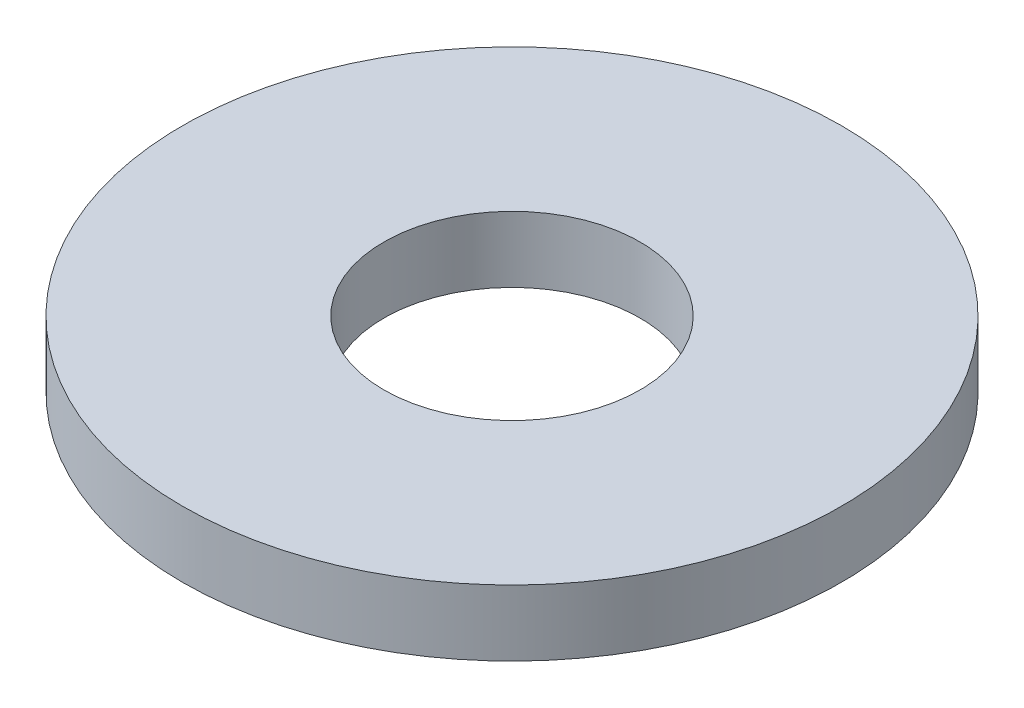
ISO-10303-21;
HEADER;
FILE_DESCRIPTION(('STEP AP214'),'2;1');
FILE_NAME('part.step','',(''),(''),'','','');
FILE_SCHEMA(('AUTOMOTIVE_DESIGN { 1 0 10303 214 1 1 1 1 }'));
ENDSEC;
DATA;
#1=APPLICATION_CONTEXT('core data for automotive mechanical design processes');
#2=APPLICATION_PROTOCOL_DEFINITION('international standard','automotive_design',2000,#1);
#3=PRODUCT_CONTEXT('',#1,'mechanical');
#4=PRODUCT('Part','Part','',(#3));
#5=PRODUCT_RELATED_PRODUCT_CATEGORY('part','',(#4));
#6=PRODUCT_DEFINITION_FORMATION('','',#4);
#7=PRODUCT_DEFINITION_CONTEXT('part definition',#1,'design');
#8=PRODUCT_DEFINITION('design','',#6,#7);
#9=PRODUCT_DEFINITION_SHAPE('','',#8);
#10=(LENGTH_UNIT() NAMED_UNIT(*) SI_UNIT(.MILLI.,.METRE.));
#11=(NAMED_UNIT(*) PLANE_ANGLE_UNIT() SI_UNIT($,.RADIAN.));
#12=(NAMED_UNIT(*) SI_UNIT($,.STERADIAN.) SOLID_ANGLE_UNIT());
#13=UNCERTAINTY_MEASURE_WITH_UNIT(LENGTH_MEASURE(1.E-05),#10,'distance_accuracy_value','');
#14=(GEOMETRIC_REPRESENTATION_CONTEXT(3) GLOBAL_UNCERTAINTY_ASSIGNED_CONTEXT((#13)) GLOBAL_UNIT_ASSIGNED_CONTEXT((#10,
#11,#12)) REPRESENTATION_CONTEXT('',''));
#15=CARTESIAN_POINT('',(0.,0.,0.));
#16=DIRECTION('',(0.,0.,1.));
#17=DIRECTION('',(1.,0.,0.));
#18=AXIS2_PLACEMENT_3D('',#15,#16,#17);
#19=CARTESIAN_POINT('',(0.,9.,0.));
#20=DIRECTION('',(0.,-1.,0.));
#21=DIRECTION('',(0.,0.,-1.));
#22=AXIS2_PLACEMENT_3D('',#19,#20,#21);
#23=CYLINDRICAL_SURFACE('',#22,45.);
#24=CARTESIAN_POINT('',(0.,9.,0.));
#25=DIRECTION('',(0.,1.,0.));
#26=DIRECTION('',(0.,0.,1.));
#27=AXIS2_PLACEMENT_3D('',#24,#25,#26);
#28=CIRCLE('',#27,45.);
#29=CARTESIAN_POINT('',(0.,9.,45.));
#30=VERTEX_POINT('',#29);
#31=EDGE_CURVE('E10',#30,#30,#28,.T.);
#32=ORIENTED_EDGE('',*,*,#31,.F.);
#33=EDGE_LOOP('',(#32));
#34=FACE_BOUND('',#33,.T.);
#35=CARTESIAN_POINT('',(0.,0.,0.));
#36=DIRECTION('',(0.,1.,0.));
#37=DIRECTION('',(0.,0.,1.));
#38=AXIS2_PLACEMENT_3D('',#35,#36,#37);
#39=CIRCLE('',#38,45.);
#40=CARTESIAN_POINT('',(0.,0.,45.));
#41=VERTEX_POINT('',#40);
#42=EDGE_CURVE('E37',#41,#41,#39,.T.);
#43=ORIENTED_EDGE('',*,*,#42,.T.);
#44=EDGE_LOOP('',(#43));
#45=FACE_BOUND('',#44,.T.);
#46=ADVANCED_FACE('F40',(#34,#45),#23,.T.);
#47=CARTESIAN_POINT('',(0.,9.,0.));
#48=DIRECTION('',(0.,1.,0.));
#49=DIRECTION('',(0.,0.,1.));
#50=AXIS2_PLACEMENT_3D('',#47,#48,#49);
#51=PLANE('',#50);
#52=CARTESIAN_POINT('',(0.,9.,0.));
#53=DIRECTION('',(0.,1.,0.));
#54=DIRECTION('',(0.,0.,1.));
#55=AXIS2_PLACEMENT_3D('',#52,#53,#54);
#56=CIRCLE('',#55,17.5);
#57=CARTESIAN_POINT('',(0.,9.,17.5));
#58=VERTEX_POINT('',#57);
#59=EDGE_CURVE('E50',#58,#58,#56,.T.);
#60=ORIENTED_EDGE('',*,*,#59,.F.);
#61=EDGE_LOOP('',(#60));
#62=FACE_BOUND('',#61,.T.);
#63=ORIENTED_EDGE('',*,*,#31,.T.);
#64=EDGE_LOOP('',(#63));
#65=FACE_BOUND('',#64,.T.);
#66=ADVANCED_FACE('F59',(#62,#65),#51,.T.);
#67=CARTESIAN_POINT('',(0.,0.,0.));
#68=DIRECTION('',(0.,1.,0.));
#69=DIRECTION('',(0.,0.,1.));
#70=AXIS2_PLACEMENT_3D('',#67,#68,#69);
#71=PLANE('',#70);
#72=CARTESIAN_POINT('',(0.,0.,0.));
#73=DIRECTION('',(0.,1.,0.));
#74=DIRECTION('',(0.,0.,1.));
#75=AXIS2_PLACEMENT_3D('',#72,#73,#74);
#76=CIRCLE('',#75,17.5);
#77=CARTESIAN_POINT('',(0.,0.,17.5));
#78=VERTEX_POINT('',#77);
#79=EDGE_CURVE('E47',#78,#78,#76,.T.);
#80=ORIENTED_EDGE('',*,*,#79,.T.);
#81=EDGE_LOOP('',(#80));
#82=FACE_BOUND('',#81,.T.);
#83=ORIENTED_EDGE('',*,*,#42,.F.);
#84=EDGE_LOOP('',(#83));
#85=FACE_BOUND('',#84,.T.);
#86=ADVANCED_FACE('F58',(#82,#85),#71,.F.);
#87=CARTESIAN_POINT('',(0.,9.,0.));
#88=DIRECTION('',(0.,-1.,0.));
#89=DIRECTION('',(0.,0.,-1.));
#90=AXIS2_PLACEMENT_3D('',#87,#88,#89);
#91=CYLINDRICAL_SURFACE('',#90,17.5);
#92=ORIENTED_EDGE('',*,*,#59,.T.);
#93=EDGE_LOOP('',(#92));
#94=FACE_BOUND('',#93,.T.);
#95=ORIENTED_EDGE('',*,*,#79,.F.);
#96=EDGE_LOOP('',(#95));
#97=FACE_BOUND('',#96,.T.);
#98=ADVANCED_FACE('F54',(#94,#97),#91,.F.);
#99=CLOSED_SHELL('',(#46,#66,#86,#98));
#100=MANIFOLD_SOLID_BREP('B2',#99);
#101=ADVANCED_BREP_SHAPE_REPRESENTATION('',(#18,#100),#14);
#102=SHAPE_DEFINITION_REPRESENTATION(#9,#101);
ENDSEC;
END-ISO-10303-21;
